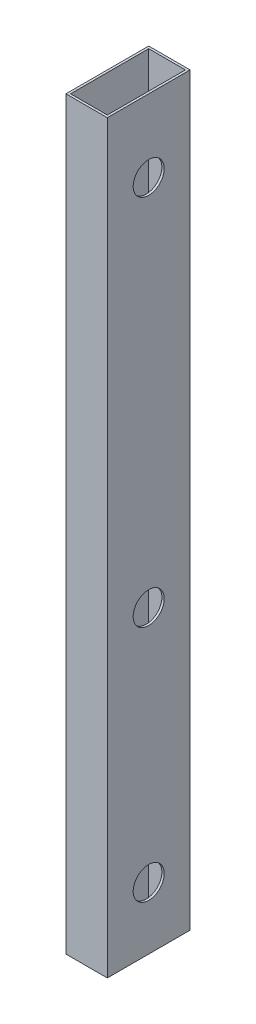
ISO-10303-21;
HEADER;
FILE_DESCRIPTION(('STEP AP214'),'2;1');
FILE_NAME('part.step','',(''),(''),'','','');
FILE_SCHEMA(('AUTOMOTIVE_DESIGN { 1 0 10303 214 1 1 1 1 }'));
ENDSEC;
DATA;
#1=APPLICATION_CONTEXT('core data for automotive mechanical design processes');
#2=APPLICATION_PROTOCOL_DEFINITION('international standard','automotive_design',2000,#1);
#3=PRODUCT_CONTEXT('',#1,'mechanical');
#4=PRODUCT('Part','Part','',(#3));
#5=PRODUCT_RELATED_PRODUCT_CATEGORY('part','',(#4));
#6=PRODUCT_DEFINITION_FORMATION('','',#4);
#7=PRODUCT_DEFINITION_CONTEXT('part definition',#1,'design');
#8=PRODUCT_DEFINITION('design','',#6,#7);
#9=PRODUCT_DEFINITION_SHAPE('','',#8);
#10=(LENGTH_UNIT() NAMED_UNIT(*) SI_UNIT(.MILLI.,.METRE.));
#11=(NAMED_UNIT(*) PLANE_ANGLE_UNIT() SI_UNIT($,.RADIAN.));
#12=(NAMED_UNIT(*) SI_UNIT($,.STERADIAN.) SOLID_ANGLE_UNIT());
#13=UNCERTAINTY_MEASURE_WITH_UNIT(LENGTH_MEASURE(1.E-05),#10,'distance_accuracy_value','');
#14=(GEOMETRIC_REPRESENTATION_CONTEXT(3) GLOBAL_UNCERTAINTY_ASSIGNED_CONTEXT((#13)) GLOBAL_UNIT_ASSIGNED_CONTEXT((#10,
#11,#12)) REPRESENTATION_CONTEXT('',''));
#15=CARTESIAN_POINT('',(0.,0.,0.));
#16=DIRECTION('',(0.,0.,1.));
#17=DIRECTION('',(1.,0.,0.));
#18=AXIS2_PLACEMENT_3D('',#15,#16,#17);
#19=CARTESIAN_POINT('',(-12.7,412.75,0.));
#20=DIRECTION('',(1.,0.,0.));
#21=DIRECTION('',(0.,0.,-1.));
#22=AXIS2_PLACEMENT_3D('',#19,#20,#21);
#23=CYLINDRICAL_SURFACE('',#22,9.525);
#24=CARTESIAN_POINT('',(11.2776,412.75,0.));
#25=DIRECTION('',(1.,0.,0.));
#26=DIRECTION('',(0.,0.,-1.));
#27=AXIS2_PLACEMENT_3D('',#24,#25,#26);
#28=CIRCLE('',#27,9.525);
#29=CARTESIAN_POINT('',(11.2776,412.75,-9.525));
#30=VERTEX_POINT('',#29);
#31=EDGE_CURVE('E121',#30,#30,#28,.T.);
#32=ORIENTED_EDGE('',*,*,#31,.F.);
#33=EDGE_LOOP('',(#32));
#34=FACE_BOUND('',#33,.T.);
#35=CARTESIAN_POINT('',(12.7,412.75,0.));
#36=DIRECTION('',(1.,0.,0.));
#37=DIRECTION('',(0.,0.,-1.));
#38=AXIS2_PLACEMENT_3D('',#35,#36,#37);
#39=CIRCLE('',#38,9.525);
#40=CARTESIAN_POINT('',(12.7,412.75,-9.525));
#41=VERTEX_POINT('',#40);
#42=EDGE_CURVE('E20',#41,#41,#39,.T.);
#43=ORIENTED_EDGE('',*,*,#42,.T.);
#44=EDGE_LOOP('',(#43));
#45=FACE_BOUND('',#44,.T.);
#46=ADVANCED_FACE('F17',(#34,#45),#23,.F.);
#47=CARTESIAN_POINT('',(-12.7,184.15,0.));
#48=DIRECTION('',(1.,0.,0.));
#49=DIRECTION('',(0.,0.,-1.));
#50=AXIS2_PLACEMENT_3D('',#47,#48,#49);
#51=CYLINDRICAL_SURFACE('',#50,9.525);
#52=CARTESIAN_POINT('',(11.2776,184.15,0.));
#53=DIRECTION('',(1.,0.,0.));
#54=DIRECTION('',(0.,0.,-1.));
#55=AXIS2_PLACEMENT_3D('',#52,#53,#54);
#56=CIRCLE('',#55,9.525);
#57=CARTESIAN_POINT('',(11.2776,184.15,-9.525));
#58=VERTEX_POINT('',#57);
#59=EDGE_CURVE('E142',#58,#58,#56,.T.);
#60=ORIENTED_EDGE('',*,*,#59,.F.);
#61=EDGE_LOOP('',(#60));
#62=FACE_BOUND('',#61,.T.);
#63=CARTESIAN_POINT('',(12.7,184.15,0.));
#64=DIRECTION('',(1.,0.,0.));
#65=DIRECTION('',(0.,0.,-1.));
#66=AXIS2_PLACEMENT_3D('',#63,#64,#65);
#67=CIRCLE('',#66,9.525);
#68=CARTESIAN_POINT('',(12.7,184.15,-9.525));
#69=VERTEX_POINT('',#68);
#70=EDGE_CURVE('E148',#69,#69,#67,.T.);
#71=ORIENTED_EDGE('',*,*,#70,.T.);
#72=EDGE_LOOP('',(#71));
#73=FACE_BOUND('',#72,.T.);
#74=ADVANCED_FACE('F261',(#62,#73),#51,.F.);
#75=CARTESIAN_POINT('',(-12.7,38.1,0.));
#76=DIRECTION('',(1.,0.,0.));
#77=DIRECTION('',(0.,0.,-1.));
#78=AXIS2_PLACEMENT_3D('',#75,#76,#77);
#79=CYLINDRICAL_SURFACE('',#78,9.525);
#80=CARTESIAN_POINT('',(11.2776000008,38.1,0.));
#81=DIRECTION('',(1.,0.,0.));
#82=DIRECTION('',(0.,0.,-1.));
#83=AXIS2_PLACEMENT_3D('',#80,#81,#82);
#84=CIRCLE('',#83,9.525);
#85=CARTESIAN_POINT('',(11.2776000008,38.1,-9.525));
#86=VERTEX_POINT('',#85);
#87=EDGE_CURVE('E119',#86,#86,#84,.T.);
#88=ORIENTED_EDGE('',*,*,#87,.F.);
#89=EDGE_LOOP('',(#88));
#90=FACE_BOUND('',#89,.T.);
#91=CARTESIAN_POINT('',(12.7,38.1,0.));
#92=DIRECTION('',(1.,0.,0.));
#93=DIRECTION('',(0.,0.,-1.));
#94=AXIS2_PLACEMENT_3D('',#91,#92,#93);
#95=CIRCLE('',#94,9.525);
#96=CARTESIAN_POINT('',(12.7,38.1,-9.525));
#97=VERTEX_POINT('',#96);
#98=EDGE_CURVE('E122',#97,#97,#95,.T.);
#99=ORIENTED_EDGE('',*,*,#98,.T.);
#100=EDGE_LOOP('',(#99));
#101=FACE_BOUND('',#100,.T.);
#102=ADVANCED_FACE('F160',(#90,#101),#79,.F.);
#103=CARTESIAN_POINT('',(12.7,457.2,-25.4));
#104=DIRECTION('',(-1.,0.,0.));
#105=DIRECTION('',(0.,0.,1.));
#106=AXIS2_PLACEMENT_3D('',#103,#104,#105);
#107=PLANE('',#106);
#108=ORIENTED_EDGE('',*,*,#98,.F.);
#109=EDGE_LOOP('',(#108));
#110=FACE_BOUND('',#109,.T.);
#111=ORIENTED_EDGE('',*,*,#70,.F.);
#112=EDGE_LOOP('',(#111));
#113=FACE_BOUND('',#112,.T.);
#114=ORIENTED_EDGE('',*,*,#42,.F.);
#115=EDGE_LOOP('',(#114));
#116=FACE_BOUND('',#115,.T.);
#117=DIRECTION('',(0.,1.,0.));
#118=VECTOR('',#117,1.);
#119=CARTESIAN_POINT('',(12.7,457.2,-25.4));
#120=LINE('',#119,#118);
#121=CARTESIAN_POINT('',(12.7,5.58803392694816E-10,-25.4));
#122=VERTEX_POINT('',#121);
#123=CARTESIAN_POINT('',(12.7,457.2,-25.4));
#124=VERTEX_POINT('',#123);
#125=EDGE_CURVE('E101',#122,#124,#120,.T.);
#126=ORIENTED_EDGE('',*,*,#125,.T.);
#127=DIRECTION('',(0.,0.,1.));
#128=VECTOR('',#127,1.);
#129=CARTESIAN_POINT('',(12.7,457.2,0.));
#130=LINE('',#129,#128);
#131=CARTESIAN_POINT('',(12.7,457.2,25.400000000175));
#132=VERTEX_POINT('',#131);
#133=EDGE_CURVE('E111',#132,#124,#130,.F.);
#134=ORIENTED_EDGE('',*,*,#133,.F.);
#135=DIRECTION('',(0.,1.,0.));
#136=VECTOR('',#135,1.);
#137=CARTESIAN_POINT('',(12.7,457.2,25.4));
#138=LINE('',#137,#136);
#139=CARTESIAN_POINT('',(12.7,5.58802615044098E-10,25.400000000175));
#140=VERTEX_POINT('',#139);
#141=EDGE_CURVE('E199',#132,#140,#138,.F.);
#142=ORIENTED_EDGE('',*,*,#141,.T.);
#143=DIRECTION('',(0.,0.,1.));
#144=VECTOR('',#143,1.);
#145=CARTESIAN_POINT('',(12.7,0.,0.));
#146=LINE('',#145,#144);
#147=EDGE_CURVE('E166',#140,#122,#146,.F.);
#148=ORIENTED_EDGE('',*,*,#147,.T.);
#149=EDGE_LOOP('',(#126,#134,#142,#148));
#150=FACE_BOUND('',#149,.T.);
#151=ADVANCED_FACE('F156',(#110,#113,#116,#150),#107,.F.);
#152=CARTESIAN_POINT('',(11.2776,457.2,-23.9776));
#153=DIRECTION('',(0.,0.,1.));
#154=DIRECTION('',(1.,0.,0.));
#155=AXIS2_PLACEMENT_3D('',#152,#153,#154);
#156=PLANE('',#155);
#157=DIRECTION('',(1.,0.,0.));
#158=VECTOR('',#157,1.);
#159=CARTESIAN_POINT('',(0.,457.2,-23.9775999997));
#160=LINE('',#159,#158);
#161=CARTESIAN_POINT('',(-11.2776,457.2,-23.977599999775));
#162=VERTEX_POINT('',#161);
#163=CARTESIAN_POINT('',(11.2776,457.2,-23.977599999925));
#164=VERTEX_POINT('',#163);
#165=EDGE_CURVE('E105',#162,#164,#160,.T.);
#166=ORIENTED_EDGE('',*,*,#165,.F.);
#167=DIRECTION('',(0.,1.,0.));
#168=VECTOR('',#167,1.);
#169=CARTESIAN_POINT('',(-11.2776,457.2,-23.9775999997));
#170=LINE('',#169,#168);
#171=CARTESIAN_POINT('',(-11.2776,5.58803370920596E-10,-23.977599999775));
#172=VERTEX_POINT('',#171);
#173=EDGE_CURVE('E102',#172,#162,#170,.T.);
#174=ORIENTED_EDGE('',*,*,#173,.F.);
#175=DIRECTION('',(1.,0.,0.));
#176=VECTOR('',#175,1.);
#177=CARTESIAN_POINT('',(0.,0.,-23.9775999997));
#178=LINE('',#177,#176);
#179=CARTESIAN_POINT('',(11.2776,5.58803370920596E-10,-23.977599999925));
#180=VERTEX_POINT('',#179);
#181=EDGE_CURVE('E190',#172,#180,#178,.T.);
#182=ORIENTED_EDGE('',*,*,#181,.T.);
#183=DIRECTION('',(0.,1.,0.));
#184=VECTOR('',#183,1.);
#185=CARTESIAN_POINT('',(11.2776,457.2,-23.9776));
#186=LINE('',#185,#184);
#187=EDGE_CURVE('E120',#164,#180,#186,.F.);
#188=ORIENTED_EDGE('',*,*,#187,.F.);
#189=EDGE_LOOP('',(#166,#174,#182,#188));
#190=FACE_BOUND('',#189,.T.);
#191=ADVANCED_FACE('F159',(#190),#156,.T.);
#192=CARTESIAN_POINT('',(11.2776,457.2,-23.9776));
#193=DIRECTION('',(-1.,0.,0.));
#194=DIRECTION('',(0.,0.,1.));
#195=AXIS2_PLACEMENT_3D('',#192,#193,#194);
#196=PLANE('',#195);
#197=ORIENTED_EDGE('',*,*,#87,.T.);
#198=EDGE_LOOP('',(#197));
#199=FACE_BOUND('',#198,.T.);
#200=ORIENTED_EDGE('',*,*,#59,.T.);
#201=EDGE_LOOP('',(#200));
#202=FACE_BOUND('',#201,.T.);
#203=ORIENTED_EDGE('',*,*,#31,.T.);
#204=EDGE_LOOP('',(#203));
#205=FACE_BOUND('',#204,.T.);
#206=DIRECTION('',(0.,0.,1.));
#207=VECTOR('',#206,1.);
#208=CARTESIAN_POINT('',(11.2776,457.2,0.));
#209=LINE('',#208,#207);
#210=CARTESIAN_POINT('',(11.2775999997,457.2,23.9776));
#211=VERTEX_POINT('',#210);
#212=EDGE_CURVE('E89',#164,#211,#209,.T.);
#213=ORIENTED_EDGE('',*,*,#212,.F.);
#214=ORIENTED_EDGE('',*,*,#187,.T.);
#215=DIRECTION('',(0.,0.,1.));
#216=VECTOR('',#215,1.);
#217=CARTESIAN_POINT('',(11.2776,0.,0.));
#218=LINE('',#217,#216);
#219=CARTESIAN_POINT('',(11.27759999985,5.58802636818318E-10,23.9776));
#220=VERTEX_POINT('',#219);
#221=EDGE_CURVE('E187',#180,#220,#218,.T.);
#222=ORIENTED_EDGE('',*,*,#221,.T.);
#223=DIRECTION('',(0.,1.,0.));
#224=VECTOR('',#223,1.);
#225=CARTESIAN_POINT('',(11.2775999994,457.2,23.9776));
#226=LINE('',#225,#224);
#227=EDGE_CURVE('E117',#211,#220,#226,.F.);
#228=ORIENTED_EDGE('',*,*,#227,.F.);
#229=EDGE_LOOP('',(#213,#214,#222,#228));
#230=FACE_BOUND('',#229,.T.);
#231=ADVANCED_FACE('F250',(#199,#202,#205,#230),#196,.T.);
#232=CARTESIAN_POINT('',(-11.2776,457.2,23.9776));
#233=DIRECTION('',(0.,0.,-1.));
#234=DIRECTION('',(-1.,0.,0.));
#235=AXIS2_PLACEMENT_3D('',#232,#233,#234);
#236=PLANE('',#235);
#237=DIRECTION('',(1.,0.,0.));
#238=VECTOR('',#237,1.);
#239=CARTESIAN_POINT('',(0.,457.2,23.9776));
#240=LINE('',#239,#238);
#241=CARTESIAN_POINT('',(-11.2776,457.2,23.9776));
#242=VERTEX_POINT('',#241);
#243=EDGE_CURVE('E81',#211,#242,#240,.F.);
#244=ORIENTED_EDGE('',*,*,#243,.F.);
#245=ORIENTED_EDGE('',*,*,#227,.T.);
#246=DIRECTION('',(1.,0.,0.));
#247=VECTOR('',#246,1.);
#248=CARTESIAN_POINT('',(0.,0.,23.9776));
#249=LINE('',#248,#247);
#250=CARTESIAN_POINT('',(-11.2776,5.58802636818318E-10,23.9776));
#251=VERTEX_POINT('',#250);
#252=EDGE_CURVE('E97',#220,#251,#249,.F.);
#253=ORIENTED_EDGE('',*,*,#252,.T.);
#254=DIRECTION('',(0.,1.,0.));
#255=VECTOR('',#254,1.);
#256=CARTESIAN_POINT('',(-11.2776,457.2,23.9776));
#257=LINE('',#256,#255);
#258=EDGE_CURVE('E94',#242,#251,#257,.F.);
#259=ORIENTED_EDGE('',*,*,#258,.F.);
#260=EDGE_LOOP('',(#244,#245,#253,#259));
#261=FACE_BOUND('',#260,.T.);
#262=ADVANCED_FACE('F95',(#261),#236,.T.);
#263=CARTESIAN_POINT('',(-11.2776,457.2,23.9776));
#264=DIRECTION('',(1.,0.,0.));
#265=DIRECTION('',(0.,0.,-1.));
#266=AXIS2_PLACEMENT_3D('',#263,#264,#265);
#267=PLANE('',#266);
#268=CARTESIAN_POINT('',(-11.2776,38.1,0.));
#269=DIRECTION('',(1.,0.,0.));
#270=DIRECTION('',(0.,0.,-1.));
#271=AXIS2_PLACEMENT_3D('',#268,#269,#270);
#272=CIRCLE('',#271,9.525);
#273=CARTESIAN_POINT('',(-11.2776,38.1,-9.525));
#274=VERTEX_POINT('',#273);
#275=EDGE_CURVE('E130',#274,#274,#272,.F.);
#276=ORIENTED_EDGE('',*,*,#275,.T.);
#277=EDGE_LOOP('',(#276));
#278=FACE_BOUND('',#277,.T.);
#279=CARTESIAN_POINT('',(-11.2776,184.15,0.));
#280=DIRECTION('',(1.,0.,0.));
#281=DIRECTION('',(0.,0.,-1.));
#282=AXIS2_PLACEMENT_3D('',#279,#280,#281);
#283=CIRCLE('',#282,9.525);
#284=CARTESIAN_POINT('',(-11.2776,184.15,-9.525));
#285=VERTEX_POINT('',#284);
#286=EDGE_CURVE('E134',#285,#285,#283,.F.);
#287=ORIENTED_EDGE('',*,*,#286,.T.);
#288=EDGE_LOOP('',(#287));
#289=FACE_BOUND('',#288,.T.);
#290=CARTESIAN_POINT('',(-11.2776,412.75,0.));
#291=DIRECTION('',(1.,0.,0.));
#292=DIRECTION('',(0.,0.,-1.));
#293=AXIS2_PLACEMENT_3D('',#290,#291,#292);
#294=CIRCLE('',#293,9.525);
#295=CARTESIAN_POINT('',(-11.2776,412.75,-9.525));
#296=VERTEX_POINT('',#295);
#297=EDGE_CURVE('E137',#296,#296,#294,.F.);
#298=ORIENTED_EDGE('',*,*,#297,.T.);
#299=EDGE_LOOP('',(#298));
#300=FACE_BOUND('',#299,.T.);
#301=DIRECTION('',(0.,0.,1.));
#302=VECTOR('',#301,1.);
#303=CARTESIAN_POINT('',(-11.2776,457.2,0.));
#304=LINE('',#303,#302);
#305=EDGE_CURVE('E86',#242,#162,#304,.F.);
#306=ORIENTED_EDGE('',*,*,#305,.F.);
#307=ORIENTED_EDGE('',*,*,#258,.T.);
#308=DIRECTION('',(0.,0.,1.));
#309=VECTOR('',#308,1.);
#310=CARTESIAN_POINT('',(-11.2776,0.,0.));
#311=LINE('',#310,#309);
#312=EDGE_CURVE('E193',#251,#172,#311,.F.);
#313=ORIENTED_EDGE('',*,*,#312,.T.);
#314=ORIENTED_EDGE('',*,*,#173,.T.);
#315=EDGE_LOOP('',(#306,#307,#313,#314));
#316=FACE_BOUND('',#315,.T.);
#317=ADVANCED_FACE('F104',(#278,#289,#300,#316),#267,.T.);
#318=CARTESIAN_POINT('',(12.7,457.2,-25.4));
#319=DIRECTION('',(0.,0.,1.));
#320=DIRECTION('',(1.,0.,0.));
#321=AXIS2_PLACEMENT_3D('',#318,#319,#320);
#322=PLANE('',#321);
#323=DIRECTION('',(0.,1.,0.));
#324=VECTOR('',#323,1.);
#325=CARTESIAN_POINT('',(-12.7,457.2,-25.4));
#326=LINE('',#325,#324);
#327=CARTESIAN_POINT('',(-12.7000000003,5.58803392694816E-10,-25.4));
#328=VERTEX_POINT('',#327);
#329=CARTESIAN_POINT('',(-12.7000000003,457.2,-25.4));
#330=VERTEX_POINT('',#329);
#331=EDGE_CURVE('E133',#328,#330,#326,.T.);
#332=ORIENTED_EDGE('',*,*,#331,.T.);
#333=DIRECTION('',(1.,0.,0.));
#334=VECTOR('',#333,1.);
#335=CARTESIAN_POINT('',(0.,457.2,-25.4));
#336=LINE('',#335,#334);
#337=EDGE_CURVE('E91',#124,#330,#336,.F.);
#338=ORIENTED_EDGE('',*,*,#337,.F.);
#339=ORIENTED_EDGE('',*,*,#125,.F.);
#340=DIRECTION('',(1.,0.,0.));
#341=VECTOR('',#340,1.);
#342=CARTESIAN_POINT('',(0.,0.,-25.4));
#343=LINE('',#342,#341);
#344=EDGE_CURVE('E197',#122,#328,#343,.F.);
#345=ORIENTED_EDGE('',*,*,#344,.T.);
#346=EDGE_LOOP('',(#332,#338,#339,#345));
#347=FACE_BOUND('',#346,.T.);
#348=ADVANCED_FACE('F171',(#347),#322,.F.);
#349=CARTESIAN_POINT('',(0.,457.2,0.));
#350=DIRECTION('',(0.,1.,0.));
#351=DIRECTION('',(0.,0.,1.));
#352=AXIS2_PLACEMENT_3D('',#349,#350,#351);
#353=PLANE('',#352);
#354=ORIENTED_EDGE('',*,*,#165,.T.);
#355=ORIENTED_EDGE('',*,*,#212,.T.);
#356=ORIENTED_EDGE('',*,*,#243,.T.);
#357=ORIENTED_EDGE('',*,*,#305,.T.);
#358=EDGE_LOOP('',(#354,#355,#356,#357));
#359=FACE_BOUND('',#358,.T.);
#360=DIRECTION('',(0.,0.,-1.));
#361=VECTOR('',#360,1.);
#362=CARTESIAN_POINT('',(-12.7,457.2,25.4));
#363=LINE('',#362,#361);
#364=CARTESIAN_POINT('',(-12.7000000002,457.2,25.4));
#365=VERTEX_POINT('',#364);
#366=EDGE_CURVE('E175',#330,#365,#363,.F.);
#367=ORIENTED_EDGE('',*,*,#366,.T.);
#368=DIRECTION('',(-1.,0.,0.));
#369=VECTOR('',#368,1.);
#370=CARTESIAN_POINT('',(-12.7,457.2,25.4));
#371=LINE('',#370,#369);
#372=EDGE_CURVE('E201',#365,#132,#371,.F.);
#373=ORIENTED_EDGE('',*,*,#372,.T.);
#374=ORIENTED_EDGE('',*,*,#133,.T.);
#375=ORIENTED_EDGE('',*,*,#337,.T.);
#376=EDGE_LOOP('',(#367,#373,#374,#375));
#377=FACE_BOUND('',#376,.T.);
#378=ADVANCED_FACE('F83',(#359,#377),#353,.T.);
#379=CARTESIAN_POINT('',(-12.7,457.2,25.4));
#380=DIRECTION('',(0.,0.,-1.));
#381=DIRECTION('',(-1.,0.,0.));
#382=AXIS2_PLACEMENT_3D('',#379,#380,#381);
#383=PLANE('',#382);
#384=ORIENTED_EDGE('',*,*,#141,.F.);
#385=ORIENTED_EDGE('',*,*,#372,.F.);
#386=DIRECTION('',(0.,1.,0.));
#387=VECTOR('',#386,1.);
#388=CARTESIAN_POINT('',(-12.7,457.2,25.4));
#389=LINE('',#388,#387);
#390=CARTESIAN_POINT('',(-12.7000000001,5.58802615044098E-10,25.4));
#391=VERTEX_POINT('',#390);
#392=EDGE_CURVE('E180',#365,#391,#389,.F.);
#393=ORIENTED_EDGE('',*,*,#392,.T.);
#394=DIRECTION('',(1.,0.,0.));
#395=VECTOR('',#394,1.);
#396=CARTESIAN_POINT('',(0.,0.,25.4));
#397=LINE('',#396,#395);
#398=EDGE_CURVE('E35',#391,#140,#397,.T.);
#399=ORIENTED_EDGE('',*,*,#398,.T.);
#400=EDGE_LOOP('',(#384,#385,#393,#399));
#401=FACE_BOUND('',#400,.T.);
#402=ADVANCED_FACE('F203',(#401),#383,.F.);
#403=CARTESIAN_POINT('',(0.,0.,0.));
#404=DIRECTION('',(0.,1.,0.));
#405=DIRECTION('',(0.,0.,1.));
#406=AXIS2_PLACEMENT_3D('',#403,#404,#405);
#407=PLANE('',#406);
#408=ORIENTED_EDGE('',*,*,#221,.F.);
#409=ORIENTED_EDGE('',*,*,#181,.F.);
#410=ORIENTED_EDGE('',*,*,#312,.F.);
#411=ORIENTED_EDGE('',*,*,#252,.F.);
#412=EDGE_LOOP('',(#408,#409,#410,#411));
#413=FACE_BOUND('',#412,.T.);
#414=ORIENTED_EDGE('',*,*,#398,.F.);
#415=DIRECTION('',(0.,0.,-1.));
#416=VECTOR('',#415,1.);
#417=CARTESIAN_POINT('',(-12.7,7.45070671825943E-10,25.4));
#418=LINE('',#417,#416);
#419=EDGE_CURVE('E129',#391,#328,#418,.T.);
#420=ORIENTED_EDGE('',*,*,#419,.T.);
#421=ORIENTED_EDGE('',*,*,#344,.F.);
#422=ORIENTED_EDGE('',*,*,#147,.F.);
#423=EDGE_LOOP('',(#414,#420,#421,#422));
#424=FACE_BOUND('',#423,.T.);
#425=ADVANCED_FACE('F204',(#413,#424),#407,.F.);
#426=CARTESIAN_POINT('',(-12.7,412.75,0.));
#427=DIRECTION('',(1.,0.,0.));
#428=DIRECTION('',(0.,0.,-1.));
#429=AXIS2_PLACEMENT_3D('',#426,#427,#428);
#430=CYLINDRICAL_SURFACE('',#429,9.525);
#431=CARTESIAN_POINT('',(-12.7,412.75,0.));
#432=DIRECTION('',(1.,0.,0.));
#433=DIRECTION('',(0.,0.,-1.));
#434=AXIS2_PLACEMENT_3D('',#431,#432,#433);
#435=CIRCLE('',#434,9.525);
#436=CARTESIAN_POINT('',(-12.7,412.75,-9.525));
#437=VERTEX_POINT('',#436);
#438=EDGE_CURVE('E126',#437,#437,#435,.F.);
#439=ORIENTED_EDGE('',*,*,#438,.T.);
#440=EDGE_LOOP('',(#439));
#441=FACE_BOUND('',#440,.T.);
#442=ORIENTED_EDGE('',*,*,#297,.F.);
#443=EDGE_LOOP('',(#442));
#444=FACE_BOUND('',#443,.T.);
#445=ADVANCED_FACE('F206',(#441,#444),#430,.F.);
#446=CARTESIAN_POINT('',(-12.7,184.15,0.));
#447=DIRECTION('',(1.,0.,0.));
#448=DIRECTION('',(0.,0.,-1.));
#449=AXIS2_PLACEMENT_3D('',#446,#447,#448);
#450=CYLINDRICAL_SURFACE('',#449,9.525);
#451=CARTESIAN_POINT('',(-12.7,184.15,0.));
#452=DIRECTION('',(1.,0.,0.));
#453=DIRECTION('',(0.,0.,-1.));
#454=AXIS2_PLACEMENT_3D('',#451,#452,#453);
#455=CIRCLE('',#454,9.525);
#456=CARTESIAN_POINT('',(-12.7,184.15,-9.525));
#457=VERTEX_POINT('',#456);
#458=EDGE_CURVE('E26',#457,#457,#455,.F.);
#459=ORIENTED_EDGE('',*,*,#458,.T.);
#460=EDGE_LOOP('',(#459));
#461=FACE_BOUND('',#460,.T.);
#462=ORIENTED_EDGE('',*,*,#286,.F.);
#463=EDGE_LOOP('',(#462));
#464=FACE_BOUND('',#463,.T.);
#465=ADVANCED_FACE('F214',(#461,#464),#450,.F.);
#466=CARTESIAN_POINT('',(-12.7,38.1,0.));
#467=DIRECTION('',(1.,0.,0.));
#468=DIRECTION('',(0.,0.,-1.));
#469=AXIS2_PLACEMENT_3D('',#466,#467,#468);
#470=CYLINDRICAL_SURFACE('',#469,9.525);
#471=CARTESIAN_POINT('',(-12.7,38.1,0.));
#472=DIRECTION('',(1.,0.,0.));
#473=DIRECTION('',(0.,0.,-1.));
#474=AXIS2_PLACEMENT_3D('',#471,#472,#473);
#475=CIRCLE('',#474,9.525);
#476=CARTESIAN_POINT('',(-12.7,38.1,-9.525));
#477=VERTEX_POINT('',#476);
#478=EDGE_CURVE('E11',#477,#477,#475,.F.);
#479=ORIENTED_EDGE('',*,*,#478,.T.);
#480=EDGE_LOOP('',(#479));
#481=FACE_BOUND('',#480,.T.);
#482=ORIENTED_EDGE('',*,*,#275,.F.);
#483=EDGE_LOOP('',(#482));
#484=FACE_BOUND('',#483,.T.);
#485=ADVANCED_FACE('F220',(#481,#484),#470,.F.);
#486=CARTESIAN_POINT('',(-12.7,457.2,25.4));
#487=DIRECTION('',(1.,0.,0.));
#488=DIRECTION('',(0.,0.,-1.));
#489=AXIS2_PLACEMENT_3D('',#486,#487,#488);
#490=PLANE('',#489);
#491=ORIENTED_EDGE('',*,*,#478,.F.);
#492=EDGE_LOOP('',(#491));
#493=FACE_BOUND('',#492,.T.);
#494=ORIENTED_EDGE('',*,*,#458,.F.);
#495=EDGE_LOOP('',(#494));
#496=FACE_BOUND('',#495,.T.);
#497=ORIENTED_EDGE('',*,*,#438,.F.);
#498=EDGE_LOOP('',(#497));
#499=FACE_BOUND('',#498,.T.);
#500=ORIENTED_EDGE('',*,*,#392,.F.);
#501=ORIENTED_EDGE('',*,*,#366,.F.);
#502=ORIENTED_EDGE('',*,*,#331,.F.);
#503=ORIENTED_EDGE('',*,*,#419,.F.);
#504=EDGE_LOOP('',(#500,#501,#502,#503));
#505=FACE_BOUND('',#504,.T.);
#506=ADVANCED_FACE('F178',(#493,#496,#499,#505),#490,.F.);
#507=CLOSED_SHELL('',(#46,#74,#102,#151,#191,#231,#262,#317,#348,#378,#402,#425,#445,#465,#485,#506));
#508=MANIFOLD_SOLID_BREP('B1',#507);
#509=ADVANCED_BREP_SHAPE_REPRESENTATION('',(#18,#508),#14);
#510=SHAPE_DEFINITION_REPRESENTATION(#9,#509);
ENDSEC;
END-ISO-10303-21;
